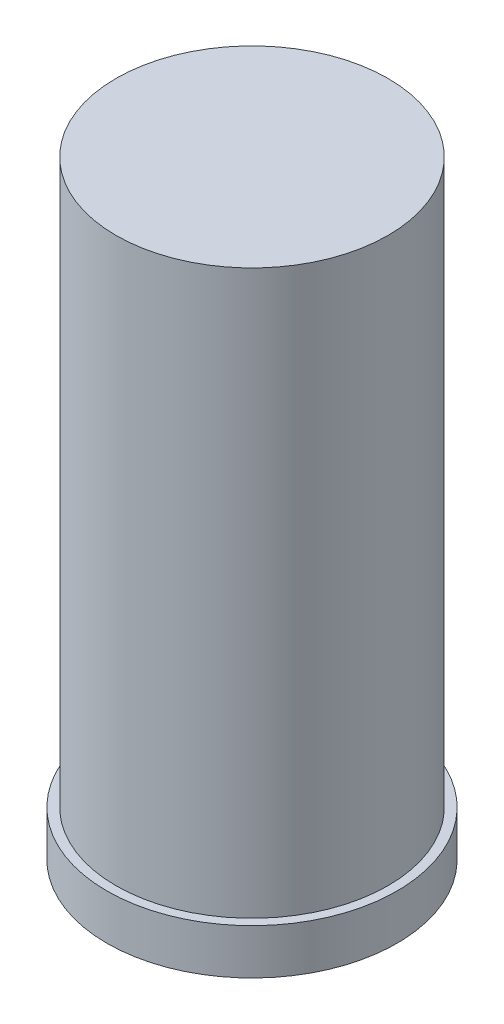
ISO-10303-21;
HEADER;
FILE_DESCRIPTION(('STEP AP214'),'2;1');
FILE_NAME('part.step','',(''),(''),'','','');
FILE_SCHEMA(('AUTOMOTIVE_DESIGN { 1 0 10303 214 1 1 1 1 }'));
ENDSEC;
DATA;
#1=APPLICATION_CONTEXT('core data for automotive mechanical design processes');
#2=APPLICATION_PROTOCOL_DEFINITION('international standard','automotive_design',2000,#1);
#3=PRODUCT_CONTEXT('',#1,'mechanical');
#4=PRODUCT('Part','Part','',(#3));
#5=PRODUCT_RELATED_PRODUCT_CATEGORY('part','',(#4));
#6=PRODUCT_DEFINITION_FORMATION('','',#4);
#7=PRODUCT_DEFINITION_CONTEXT('part definition',#1,'design');
#8=PRODUCT_DEFINITION('design','',#6,#7);
#9=PRODUCT_DEFINITION_SHAPE('','',#8);
#10=(LENGTH_UNIT() NAMED_UNIT(*) SI_UNIT(.MILLI.,.METRE.));
#11=(NAMED_UNIT(*) PLANE_ANGLE_UNIT() SI_UNIT($,.RADIAN.));
#12=(NAMED_UNIT(*) SI_UNIT($,.STERADIAN.) SOLID_ANGLE_UNIT());
#13=UNCERTAINTY_MEASURE_WITH_UNIT(LENGTH_MEASURE(1.E-05),#10,'distance_accuracy_value','');
#14=(GEOMETRIC_REPRESENTATION_CONTEXT(3) GLOBAL_UNCERTAINTY_ASSIGNED_CONTEXT((#13)) GLOBAL_UNIT_ASSIGNED_CONTEXT((#10,
#11,#12)) REPRESENTATION_CONTEXT('',''));
#15=CARTESIAN_POINT('',(0.,0.,0.));
#16=DIRECTION('',(0.,0.,1.));
#17=DIRECTION('',(1.,0.,0.));
#18=AXIS2_PLACEMENT_3D('',#15,#16,#17);
#19=CARTESIAN_POINT('',(0.,0.,0.));
#20=DIRECTION('',(0.,1.,0.));
#21=DIRECTION('',(0.,0.,1.));
#22=AXIS2_PLACEMENT_3D('',#19,#20,#21);
#23=PLANE('',#22);
#24=CARTESIAN_POINT('',(0.,0.,0.));
#25=DIRECTION('',(0.,1.,0.));
#26=DIRECTION('',(0.,0.,1.));
#27=AXIS2_PLACEMENT_3D('',#24,#25,#26);
#28=CIRCLE('',#27,4.);
#29=CARTESIAN_POINT('',(0.,0.,4.));
#30=VERTEX_POINT('',#29);
#31=EDGE_CURVE('E56',#30,#30,#28,.T.);
#32=ORIENTED_EDGE('',*,*,#31,.T.);
#33=EDGE_LOOP('',(#32));
#34=FACE_BOUND('',#33,.T.);
#35=CARTESIAN_POINT('',(0.,0.,0.));
#36=DIRECTION('',(0.,1.,0.));
#37=DIRECTION('',(0.,0.,1.));
#38=AXIS2_PLACEMENT_3D('',#35,#36,#37);
#39=CIRCLE('',#38,16.);
#40=CARTESIAN_POINT('',(0.,0.,16.));
#41=VERTEX_POINT('',#40);
#42=EDGE_CURVE('E64',#41,#41,#39,.T.);
#43=ORIENTED_EDGE('',*,*,#42,.F.);
#44=EDGE_LOOP('',(#43));
#45=FACE_BOUND('',#44,.T.);
#46=ADVANCED_FACE('F43',(#34,#45),#23,.F.);
#47=CARTESIAN_POINT('',(0.,7.,0.));
#48=DIRECTION('',(0.,-1.,0.));
#49=DIRECTION('',(0.,0.,-1.));
#50=AXIS2_PLACEMENT_3D('',#47,#48,#49);
#51=CYLINDRICAL_SURFACE('',#50,4.);
#52=CARTESIAN_POINT('',(0.,7.,0.));
#53=DIRECTION('',(0.,1.,0.));
#54=DIRECTION('',(0.,0.,1.));
#55=AXIS2_PLACEMENT_3D('',#52,#53,#54);
#56=CIRCLE('',#55,4.);
#57=CARTESIAN_POINT('',(0.,7.,4.));
#58=VERTEX_POINT('',#57);
#59=EDGE_CURVE('E51',#58,#58,#56,.T.);
#60=ORIENTED_EDGE('',*,*,#59,.T.);
#61=EDGE_LOOP('',(#60));
#62=FACE_BOUND('',#61,.T.);
#63=ORIENTED_EDGE('',*,*,#31,.F.);
#64=EDGE_LOOP('',(#63));
#65=FACE_BOUND('',#64,.T.);
#66=ADVANCED_FACE('F93',(#62,#65),#51,.F.);
#67=CARTESIAN_POINT('',(0.,7.,0.));
#68=DIRECTION('',(0.,1.,0.));
#69=DIRECTION('',(0.,0.,1.));
#70=AXIS2_PLACEMENT_3D('',#67,#68,#69);
#71=PLANE('',#70);
#72=ORIENTED_EDGE('',*,*,#59,.F.);
#73=EDGE_LOOP('',(#72));
#74=FACE_BOUND('',#73,.T.);
#75=ADVANCED_FACE('F88',(#74),#71,.F.);
#76=CARTESIAN_POINT('',(0.,5.,0.));
#77=DIRECTION('',(0.,-1.,0.));
#78=DIRECTION('',(0.,0.,-1.));
#79=AXIS2_PLACEMENT_3D('',#76,#77,#78);
#80=CYLINDRICAL_SURFACE('',#79,16.);
#81=CARTESIAN_POINT('',(0.,5.,0.));
#82=DIRECTION('',(0.,1.,0.));
#83=DIRECTION('',(0.,0.,1.));
#84=AXIS2_PLACEMENT_3D('',#81,#82,#83);
#85=CIRCLE('',#84,16.);
#86=CARTESIAN_POINT('',(0.,5.,16.));
#87=VERTEX_POINT('',#86);
#88=EDGE_CURVE('E62',#87,#87,#85,.T.);
#89=ORIENTED_EDGE('',*,*,#88,.F.);
#90=EDGE_LOOP('',(#89));
#91=FACE_BOUND('',#90,.T.);
#92=ORIENTED_EDGE('',*,*,#42,.T.);
#93=EDGE_LOOP('',(#92));
#94=FACE_BOUND('',#93,.T.);
#95=ADVANCED_FACE('F82',(#91,#94),#80,.T.);
#96=CARTESIAN_POINT('',(0.,5.,0.));
#97=DIRECTION('',(0.,1.,0.));
#98=DIRECTION('',(0.,0.,1.));
#99=AXIS2_PLACEMENT_3D('',#96,#97,#98);
#100=PLANE('',#99);
#101=CARTESIAN_POINT('',(0.,5.,0.));
#102=DIRECTION('',(0.,1.,0.));
#103=DIRECTION('',(0.,0.,1.));
#104=AXIS2_PLACEMENT_3D('',#101,#102,#103);
#105=CIRCLE('',#104,15.);
#106=CARTESIAN_POINT('',(0.,5.,15.));
#107=VERTEX_POINT('',#106);
#108=EDGE_CURVE('E68',#107,#107,#105,.T.);
#109=ORIENTED_EDGE('',*,*,#108,.F.);
#110=EDGE_LOOP('',(#109));
#111=FACE_BOUND('',#110,.T.);
#112=ORIENTED_EDGE('',*,*,#88,.T.);
#113=EDGE_LOOP('',(#112));
#114=FACE_BOUND('',#113,.T.);
#115=ADVANCED_FACE('F78',(#111,#114),#100,.T.);
#116=CARTESIAN_POINT('',(0.,67.12,0.));
#117=DIRECTION('',(0.,1.,0.));
#118=DIRECTION('',(0.,0.,1.));
#119=AXIS2_PLACEMENT_3D('',#116,#117,#118);
#120=PLANE('',#119);
#121=CARTESIAN_POINT('',(0.,67.12,0.));
#122=DIRECTION('',(0.,1.,0.));
#123=DIRECTION('',(0.,0.,1.));
#124=AXIS2_PLACEMENT_3D('',#121,#122,#123);
#125=CIRCLE('',#124,15.);
#126=CARTESIAN_POINT('',(0.,67.12,15.));
#127=VERTEX_POINT('',#126);
#128=EDGE_CURVE('E10',#127,#127,#125,.T.);
#129=ORIENTED_EDGE('',*,*,#128,.T.);
#130=EDGE_LOOP('',(#129));
#131=FACE_BOUND('',#130,.T.);
#132=ADVANCED_FACE('F81',(#131),#120,.T.);
#133=CARTESIAN_POINT('',(0.,67.12,0.));
#134=DIRECTION('',(0.,-1.,0.));
#135=DIRECTION('',(0.,0.,-1.));
#136=AXIS2_PLACEMENT_3D('',#133,#134,#135);
#137=CYLINDRICAL_SURFACE('',#136,15.);
#138=ORIENTED_EDGE('',*,*,#108,.T.);
#139=EDGE_LOOP('',(#138));
#140=FACE_BOUND('',#139,.T.);
#141=ORIENTED_EDGE('',*,*,#128,.F.);
#142=EDGE_LOOP('',(#141));
#143=FACE_BOUND('',#142,.T.);
#144=ADVANCED_FACE('F45',(#140,#143),#137,.T.);
#145=CLOSED_SHELL('',(#46,#66,#75,#95,#115,#132,#144));
#146=MANIFOLD_SOLID_BREP('B2',#145);
#147=ADVANCED_BREP_SHAPE_REPRESENTATION('',(#18,#146),#14);
#148=SHAPE_DEFINITION_REPRESENTATION(#9,#147);
ENDSEC;
END-ISO-10303-21;
